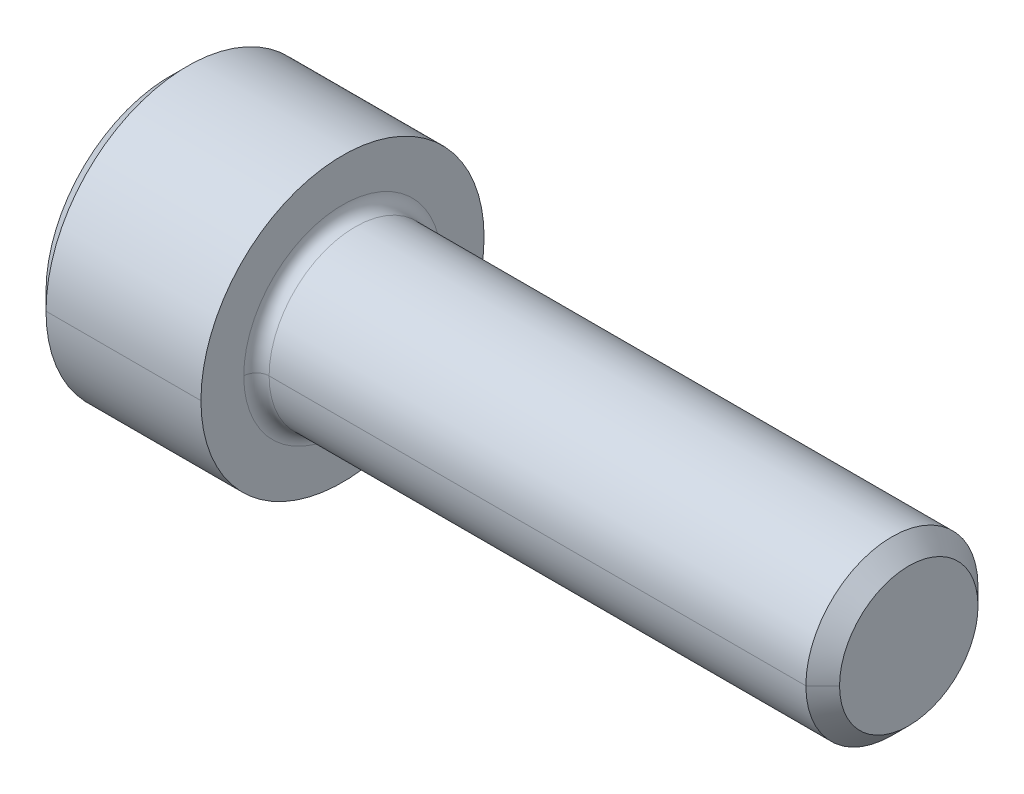
ISO-10303-21;
HEADER;
FILE_DESCRIPTION(('STEP AP214'),'2;1');
FILE_NAME('part.step','',(''),(''),'','','');
FILE_SCHEMA(('AUTOMOTIVE_DESIGN { 1 0 10303 214 1 1 1 1 }'));
ENDSEC;
DATA;
#1=APPLICATION_CONTEXT('core data for automotive mechanical design processes');
#2=APPLICATION_PROTOCOL_DEFINITION('international standard','automotive_design',2000,#1);
#3=PRODUCT_CONTEXT('',#1,'mechanical');
#4=PRODUCT('Part','Part','',(#3));
#5=PRODUCT_RELATED_PRODUCT_CATEGORY('part','',(#4));
#6=PRODUCT_DEFINITION_FORMATION('','',#4);
#7=PRODUCT_DEFINITION_CONTEXT('part definition',#1,'design');
#8=PRODUCT_DEFINITION('design','',#6,#7);
#9=PRODUCT_DEFINITION_SHAPE('','',#8);
#10=(LENGTH_UNIT() NAMED_UNIT(*) SI_UNIT(.MILLI.,.METRE.));
#11=(NAMED_UNIT(*) PLANE_ANGLE_UNIT() SI_UNIT($,.RADIAN.));
#12=(NAMED_UNIT(*) SI_UNIT($,.STERADIAN.) SOLID_ANGLE_UNIT());
#13=UNCERTAINTY_MEASURE_WITH_UNIT(LENGTH_MEASURE(1.E-05),#10,'distance_accuracy_value','');
#14=(GEOMETRIC_REPRESENTATION_CONTEXT(3) GLOBAL_UNCERTAINTY_ASSIGNED_CONTEXT((#13)) GLOBAL_UNIT_ASSIGNED_CONTEXT((#10,
#11,#12)) REPRESENTATION_CONTEXT('',''));
#15=CARTESIAN_POINT('',(0.,0.,0.));
#16=DIRECTION('',(0.,0.,1.));
#17=DIRECTION('',(1.,0.,0.));
#18=AXIS2_PLACEMENT_3D('',#15,#16,#17);
#19=CARTESIAN_POINT('',(2.286,0.,0.));
#20=DIRECTION('',(-1.,0.,0.));
#21=DIRECTION('',(0.,0.,1.));
#22=AXIS2_PLACEMENT_3D('',#19,#20,#21);
#23=CONICAL_SURFACE('',#22,1.98501,1.0471975511966);
#24=DIRECTION('',(-0.5,0.,-0.866025403784437));
#25=VECTOR('',#24,1.);
#26=CARTESIAN_POINT('',(2.286,0.,-1.98501));
#27=LINE('',#26,#25);
#28=CARTESIAN_POINT('',(3.43204605784411,0.,0.));
#29=VERTEX_POINT('',#28);
#30=CARTESIAN_POINT('',(2.286,0.,-1.98501));
#31=VERTEX_POINT('',#30);
#32=EDGE_CURVE('E173',#29,#31,#27,.T.);
#33=ORIENTED_EDGE('',*,*,#32,.F.);
#34=DIRECTION('',(-0.5,0.,0.866025403784437));
#35=VECTOR('',#34,1.);
#36=CARTESIAN_POINT('',(2.286,0.,1.98501));
#37=LINE('',#36,#35);
#38=CARTESIAN_POINT('',(2.286,0.,1.98501));
#39=VERTEX_POINT('',#38);
#40=EDGE_CURVE('E179',#29,#39,#37,.T.);
#41=ORIENTED_EDGE('',*,*,#40,.T.);
#42=CARTESIAN_POINT('',(2.286,0.,0.));
#43=DIRECTION('',(-1.,0.,0.));
#44=DIRECTION('',(0.,0.,1.));
#45=AXIS2_PLACEMENT_3D('',#42,#43,#44);
#46=CIRCLE('',#45,1.98501);
#47=CARTESIAN_POINT('',(2.286,1.71906908676615,0.992505));
#48=VERTEX_POINT('',#47);
#49=EDGE_CURVE('E11',#39,#48,#46,.T.);
#50=ORIENTED_EDGE('',*,*,#49,.T.);
#51=CARTESIAN_POINT('',(2.286,0.,0.));
#52=DIRECTION('',(-1.,0.,0.));
#53=DIRECTION('',(0.,0.,1.));
#54=AXIS2_PLACEMENT_3D('',#51,#52,#53);
#55=CIRCLE('',#54,1.98501);
#56=CARTESIAN_POINT('',(2.286,1.71906908676615,-0.992505));
#57=VERTEX_POINT('',#56);
#58=EDGE_CURVE('E20',#48,#57,#55,.T.);
#59=ORIENTED_EDGE('',*,*,#58,.T.);
#60=CARTESIAN_POINT('',(2.286,0.,0.));
#61=DIRECTION('',(-1.,0.,0.));
#62=DIRECTION('',(0.,0.,1.));
#63=AXIS2_PLACEMENT_3D('',#60,#61,#62);
#64=CIRCLE('',#63,1.98501);
#65=EDGE_CURVE('E176',#57,#31,#64,.T.);
#66=ORIENTED_EDGE('',*,*,#65,.T.);
#67=EDGE_LOOP('',(#33,#41,#50,#59,#66));
#68=FACE_BOUND('',#67,.T.);
#69=ADVANCED_FACE('F17',(#68),#23,.F.);
#70=CARTESIAN_POINT('',(2.286,1.14604605784411,1.98501));
#71=DIRECTION('',(-1.,0.,0.));
#72=DIRECTION('',(0.,0.,1.));
#73=AXIS2_PLACEMENT_3D('',#70,#71,#72);
#74=PLANE('',#73);
#75=ORIENTED_EDGE('',*,*,#49,.F.);
#76=DIRECTION('',(0.,1.,0.));
#77=VECTOR('',#76,1.);
#78=CARTESIAN_POINT('',(2.286,-1.14604605784409,1.98501));
#79=LINE('',#78,#77);
#80=CARTESIAN_POINT('',(2.286,1.14604605784411,1.98501));
#81=VERTEX_POINT('',#80);
#82=EDGE_CURVE('E206',#39,#81,#79,.T.);
#83=ORIENTED_EDGE('',*,*,#82,.T.);
#84=DIRECTION('',(0.,-0.5,0.86602540378444));
#85=VECTOR('',#84,1.);
#86=CARTESIAN_POINT('',(2.286,2.29209211568821,0.));
#87=LINE('',#86,#85);
#88=EDGE_CURVE('E210',#48,#81,#87,.T.);
#89=ORIENTED_EDGE('',*,*,#88,.F.);
#90=EDGE_LOOP('',(#75,#83,#89));
#91=FACE_BOUND('',#90,.T.);
#92=ADVANCED_FACE('F784',(#91),#74,.T.);
#93=CARTESIAN_POINT('',(2.286,1.14604605784411,1.98501));
#94=DIRECTION('',(-1.,0.,0.));
#95=DIRECTION('',(0.,0.,1.));
#96=AXIS2_PLACEMENT_3D('',#93,#94,#95);
#97=PLANE('',#96);
#98=ORIENTED_EDGE('',*,*,#58,.F.);
#99=DIRECTION('',(0.,-0.5,0.86602540378444));
#100=VECTOR('',#99,1.);
#101=CARTESIAN_POINT('',(2.286,2.29209211568821,0.));
#102=LINE('',#101,#100);
#103=CARTESIAN_POINT('',(2.286,2.29209211568821,0.));
#104=VERTEX_POINT('',#103);
#105=EDGE_CURVE('E235',#104,#48,#102,.T.);
#106=ORIENTED_EDGE('',*,*,#105,.F.);
#107=DIRECTION('',(0.,-0.5,-0.866025403784438));
#108=VECTOR('',#107,1.);
#109=CARTESIAN_POINT('',(2.286,2.29209211568821,0.));
#110=LINE('',#109,#108);
#111=EDGE_CURVE('E296',#104,#57,#110,.T.);
#112=ORIENTED_EDGE('',*,*,#111,.T.);
#113=EDGE_LOOP('',(#98,#106,#112));
#114=FACE_BOUND('',#113,.T.);
#115=ADVANCED_FACE('F677',(#114),#97,.T.);
#116=CARTESIAN_POINT('',(2.286,1.14604605784411,1.98501));
#117=DIRECTION('',(-1.,0.,0.));
#118=DIRECTION('',(0.,0.,1.));
#119=AXIS2_PLACEMENT_3D('',#116,#117,#118);
#120=PLANE('',#119);
#121=ORIENTED_EDGE('',*,*,#65,.F.);
#122=DIRECTION('',(0.,-0.5,-0.866025403784438));
#123=VECTOR('',#122,1.);
#124=CARTESIAN_POINT('',(2.286,2.29209211568821,0.));
#125=LINE('',#124,#123);
#126=CARTESIAN_POINT('',(2.286,1.1460460578441,-1.98501));
#127=VERTEX_POINT('',#126);
#128=EDGE_CURVE('E50',#57,#127,#125,.T.);
#129=ORIENTED_EDGE('',*,*,#128,.T.);
#130=DIRECTION('',(0.,-1.,0.));
#131=VECTOR('',#130,1.);
#132=CARTESIAN_POINT('',(2.286,1.1460460578441,-1.98501));
#133=LINE('',#132,#131);
#134=EDGE_CURVE('E355',#127,#31,#133,.T.);
#135=ORIENTED_EDGE('',*,*,#134,.T.);
#136=EDGE_LOOP('',(#121,#129,#135));
#137=FACE_BOUND('',#136,.T.);
#138=ADVANCED_FACE('F673',(#137),#120,.T.);
#139=CARTESIAN_POINT('',(2.286,1.14604605784411,1.98501));
#140=DIRECTION('',(-1.,0.,0.));
#141=DIRECTION('',(0.,0.,1.));
#142=AXIS2_PLACEMENT_3D('',#139,#140,#141);
#143=PLANE('',#142);
#144=CARTESIAN_POINT('',(2.286,0.,0.));
#145=DIRECTION('',(-1.,0.,0.));
#146=DIRECTION('',(0.,0.,1.));
#147=AXIS2_PLACEMENT_3D('',#144,#145,#146);
#148=CIRCLE('',#147,1.98501);
#149=CARTESIAN_POINT('',(2.286,-1.71906908676615,-0.992505));
#150=VERTEX_POINT('',#149);
#151=EDGE_CURVE('E185',#31,#150,#148,.T.);
#152=ORIENTED_EDGE('',*,*,#151,.F.);
#153=DIRECTION('',(0.,-1.,0.));
#154=VECTOR('',#153,1.);
#155=CARTESIAN_POINT('',(2.286,1.1460460578441,-1.98501));
#156=LINE('',#155,#154);
#157=CARTESIAN_POINT('',(2.286,-1.1460460578441,-1.98501));
#158=VERTEX_POINT('',#157);
#159=EDGE_CURVE('E213',#31,#158,#156,.T.);
#160=ORIENTED_EDGE('',*,*,#159,.T.);
#161=DIRECTION('',(0.,0.5,-0.86602540378444));
#162=VECTOR('',#161,1.);
#163=CARTESIAN_POINT('',(2.286,-2.2920921156882,0.));
#164=LINE('',#163,#162);
#165=EDGE_CURVE('E212',#150,#158,#164,.T.);
#166=ORIENTED_EDGE('',*,*,#165,.F.);
#167=EDGE_LOOP('',(#152,#160,#166));
#168=FACE_BOUND('',#167,.T.);
#169=ADVANCED_FACE('F678',(#168),#143,.T.);
#170=CARTESIAN_POINT('',(2.286,1.14604605784411,1.98501));
#171=DIRECTION('',(-1.,0.,0.));
#172=DIRECTION('',(0.,0.,1.));
#173=AXIS2_PLACEMENT_3D('',#170,#171,#172);
#174=PLANE('',#173);
#175=CARTESIAN_POINT('',(2.286,0.,0.));
#176=DIRECTION('',(-1.,0.,0.));
#177=DIRECTION('',(0.,0.,1.));
#178=AXIS2_PLACEMENT_3D('',#175,#176,#177);
#179=CIRCLE('',#178,1.98501);
#180=CARTESIAN_POINT('',(2.286,-1.71906908676614,0.992505));
#181=VERTEX_POINT('',#180);
#182=EDGE_CURVE('E205',#150,#181,#179,.T.);
#183=ORIENTED_EDGE('',*,*,#182,.F.);
#184=DIRECTION('',(0.,0.5,-0.86602540378444));
#185=VECTOR('',#184,1.);
#186=CARTESIAN_POINT('',(2.286,-2.2920921156882,0.));
#187=LINE('',#186,#185);
#188=CARTESIAN_POINT('',(2.286,-2.2920921156882,0.));
#189=VERTEX_POINT('',#188);
#190=EDGE_CURVE('E267',#189,#150,#187,.T.);
#191=ORIENTED_EDGE('',*,*,#190,.F.);
#192=DIRECTION('',(0.,-0.5,-0.866025403784438));
#193=VECTOR('',#192,1.);
#194=CARTESIAN_POINT('',(2.286,-1.14604605784409,1.98501));
#195=LINE('',#194,#193);
#196=EDGE_CURVE('E351',#181,#189,#195,.T.);
#197=ORIENTED_EDGE('',*,*,#196,.F.);
#198=EDGE_LOOP('',(#183,#191,#197));
#199=FACE_BOUND('',#198,.T.);
#200=ADVANCED_FACE('F862',(#199),#174,.T.);
#201=CARTESIAN_POINT('',(2.286,1.14604605784411,1.98501));
#202=DIRECTION('',(-1.,0.,0.));
#203=DIRECTION('',(0.,0.,1.));
#204=AXIS2_PLACEMENT_3D('',#201,#202,#203);
#205=PLANE('',#204);
#206=CARTESIAN_POINT('',(2.286,0.,0.));
#207=DIRECTION('',(-1.,0.,0.));
#208=DIRECTION('',(0.,0.,1.));
#209=AXIS2_PLACEMENT_3D('',#206,#207,#208);
#210=CIRCLE('',#209,1.98501);
#211=EDGE_CURVE('E190',#181,#39,#210,.T.);
#212=ORIENTED_EDGE('',*,*,#211,.F.);
#213=DIRECTION('',(0.,-0.5,-0.866025403784438));
#214=VECTOR('',#213,1.);
#215=CARTESIAN_POINT('',(2.286,-1.14604605784409,1.98501));
#216=LINE('',#215,#214);
#217=CARTESIAN_POINT('',(2.286,-1.14604605784409,1.98501));
#218=VERTEX_POINT('',#217);
#219=EDGE_CURVE('E346',#218,#181,#216,.T.);
#220=ORIENTED_EDGE('',*,*,#219,.F.);
#221=DIRECTION('',(0.,1.,0.));
#222=VECTOR('',#221,1.);
#223=CARTESIAN_POINT('',(2.286,-1.14604605784409,1.98501));
#224=LINE('',#223,#222);
#225=EDGE_CURVE('E336',#218,#39,#224,.T.);
#226=ORIENTED_EDGE('',*,*,#225,.T.);
#227=EDGE_LOOP('',(#212,#220,#226));
#228=FACE_BOUND('',#227,.T.);
#229=ADVANCED_FACE('F858',(#228),#205,.T.);
#230=CARTESIAN_POINT('',(2.286,2.29209211568821,0.));
#231=DIRECTION('',(0.,0.866025403784438,-0.5));
#232=DIRECTION('',(-1.,0.,0.));
#233=AXIS2_PLACEMENT_3D('',#230,#231,#232);
#234=PLANE('',#233);
#235=DIRECTION('',(0.,-0.5,-0.866025403784438));
#236=VECTOR('',#235,1.);
#237=CARTESIAN_POINT('',(0.,2.29209211568821,0.));
#238=LINE('',#237,#236);
#239=CARTESIAN_POINT('',(0.,2.29209211568821,0.));
#240=VERTEX_POINT('',#239);
#241=CARTESIAN_POINT('',(0.,1.1460460578441,-1.98501));
#242=VERTEX_POINT('',#241);
#243=EDGE_CURVE('E314',#240,#242,#238,.T.);
#244=ORIENTED_EDGE('',*,*,#243,.T.);
#245=DIRECTION('',(-1.,0.,0.));
#246=VECTOR('',#245,1.);
#247=CARTESIAN_POINT('',(2.286,1.1460460578441,-1.98501));
#248=LINE('',#247,#246);
#249=EDGE_CURVE('E354',#127,#242,#248,.T.);
#250=ORIENTED_EDGE('',*,*,#249,.F.);
#251=ORIENTED_EDGE('',*,*,#128,.F.);
#252=ORIENTED_EDGE('',*,*,#111,.F.);
#253=DIRECTION('',(-1.,0.,0.));
#254=VECTOR('',#253,1.);
#255=CARTESIAN_POINT('',(2.286,2.29209211568821,0.));
#256=LINE('',#255,#254);
#257=EDGE_CURVE('E236',#104,#240,#256,.T.);
#258=ORIENTED_EDGE('',*,*,#257,.T.);
#259=EDGE_LOOP('',(#244,#250,#251,#252,#258));
#260=FACE_BOUND('',#259,.T.);
#261=ADVANCED_FACE('F850',(#260),#234,.F.);
#262=CARTESIAN_POINT('',(2.286,1.1460460578441,-1.98501));
#263=DIRECTION('',(0.,0.,-1.));
#264=DIRECTION('',(0.,-1.,0.));
#265=AXIS2_PLACEMENT_3D('',#262,#263,#264);
#266=PLANE('',#265);
#267=DIRECTION('',(0.,-1.,0.));
#268=VECTOR('',#267,1.);
#269=CARTESIAN_POINT('',(0.,1.1460460578441,-1.98501));
#270=LINE('',#269,#268);
#271=CARTESIAN_POINT('',(0.,-1.1460460578441,-1.98501));
#272=VERTEX_POINT('',#271);
#273=EDGE_CURVE('E309',#242,#272,#270,.T.);
#274=ORIENTED_EDGE('',*,*,#273,.T.);
#275=DIRECTION('',(-1.,0.,0.));
#276=VECTOR('',#275,1.);
#277=CARTESIAN_POINT('',(2.286,-1.1460460578441,-1.98501));
#278=LINE('',#277,#276);
#279=EDGE_CURVE('E209',#158,#272,#278,.T.);
#280=ORIENTED_EDGE('',*,*,#279,.F.);
#281=ORIENTED_EDGE('',*,*,#159,.F.);
#282=ORIENTED_EDGE('',*,*,#134,.F.);
#283=ORIENTED_EDGE('',*,*,#249,.T.);
#284=EDGE_LOOP('',(#274,#280,#281,#282,#283));
#285=FACE_BOUND('',#284,.T.);
#286=ADVANCED_FACE('F840',(#285),#266,.F.);
#287=CARTESIAN_POINT('',(2.286,-2.2920921156882,0.));
#288=DIRECTION('',(0.,0.866025403784439,0.5));
#289=DIRECTION('',(1.,0.,0.));
#290=AXIS2_PLACEMENT_3D('',#287,#288,#289);
#291=PLANE('',#290);
#292=DIRECTION('',(0.,0.5,-0.86602540378444));
#293=VECTOR('',#292,1.);
#294=CARTESIAN_POINT('',(0.,-2.2920921156882,0.));
#295=LINE('',#294,#293);
#296=CARTESIAN_POINT('',(0.,-2.2920921156882,0.));
#297=VERTEX_POINT('',#296);
#298=EDGE_CURVE('E308',#297,#272,#295,.T.);
#299=ORIENTED_EDGE('',*,*,#298,.F.);
#300=DIRECTION('',(-1.,0.,0.));
#301=VECTOR('',#300,1.);
#302=CARTESIAN_POINT('',(2.286,-2.2920921156882,0.));
#303=LINE('',#302,#301);
#304=EDGE_CURVE('E356',#189,#297,#303,.T.);
#305=ORIENTED_EDGE('',*,*,#304,.F.);
#306=ORIENTED_EDGE('',*,*,#190,.T.);
#307=ORIENTED_EDGE('',*,*,#165,.T.);
#308=ORIENTED_EDGE('',*,*,#279,.T.);
#309=EDGE_LOOP('',(#299,#305,#306,#307,#308));
#310=FACE_BOUND('',#309,.T.);
#311=ADVANCED_FACE('F826',(#310),#291,.T.);
#312=CARTESIAN_POINT('',(2.286,-1.14604605784409,1.98501));
#313=DIRECTION('',(0.,0.866025403784438,-0.5));
#314=DIRECTION('',(-1.,0.,0.));
#315=AXIS2_PLACEMENT_3D('',#312,#313,#314);
#316=PLANE('',#315);
#317=DIRECTION('',(0.,-0.5,-0.866025403784438));
#318=VECTOR('',#317,1.);
#319=CARTESIAN_POINT('',(0.,-1.14604605784409,1.98501));
#320=LINE('',#319,#318);
#321=CARTESIAN_POINT('',(0.,-1.14604605784409,1.98501));
#322=VERTEX_POINT('',#321);
#323=EDGE_CURVE('E218',#322,#297,#320,.T.);
#324=ORIENTED_EDGE('',*,*,#323,.F.);
#325=DIRECTION('',(-1.,0.,0.));
#326=VECTOR('',#325,1.);
#327=CARTESIAN_POINT('',(2.286,-1.14604605784409,1.98501));
#328=LINE('',#327,#326);
#329=EDGE_CURVE('E343',#218,#322,#328,.T.);
#330=ORIENTED_EDGE('',*,*,#329,.F.);
#331=ORIENTED_EDGE('',*,*,#219,.T.);
#332=ORIENTED_EDGE('',*,*,#196,.T.);
#333=ORIENTED_EDGE('',*,*,#304,.T.);
#334=EDGE_LOOP('',(#324,#330,#331,#332,#333));
#335=FACE_BOUND('',#334,.T.);
#336=ADVANCED_FACE('F718',(#335),#316,.T.);
#337=CARTESIAN_POINT('',(2.286,-1.14604605784409,1.98501));
#338=DIRECTION('',(0.,0.,1.));
#339=DIRECTION('',(0.,-1.,0.));
#340=AXIS2_PLACEMENT_3D('',#337,#338,#339);
#341=PLANE('',#340);
#342=DIRECTION('',(0.,1.,0.));
#343=VECTOR('',#342,1.);
#344=CARTESIAN_POINT('',(0.,-1.14604605784409,1.98501));
#345=LINE('',#344,#343);
#346=CARTESIAN_POINT('',(0.,1.14604605784411,1.98501));
#347=VERTEX_POINT('',#346);
#348=EDGE_CURVE('E214',#322,#347,#345,.T.);
#349=ORIENTED_EDGE('',*,*,#348,.T.);
#350=DIRECTION('',(-1.,0.,0.));
#351=VECTOR('',#350,1.);
#352=CARTESIAN_POINT('',(2.286,1.14604605784411,1.98501));
#353=LINE('',#352,#351);
#354=EDGE_CURVE('E201',#81,#347,#353,.T.);
#355=ORIENTED_EDGE('',*,*,#354,.F.);
#356=ORIENTED_EDGE('',*,*,#82,.F.);
#357=ORIENTED_EDGE('',*,*,#225,.F.);
#358=ORIENTED_EDGE('',*,*,#329,.T.);
#359=EDGE_LOOP('',(#349,#355,#356,#357,#358));
#360=FACE_BOUND('',#359,.T.);
#361=ADVANCED_FACE('F714',(#360),#341,.F.);
#362=CARTESIAN_POINT('',(2.286,2.29209211568821,0.));
#363=DIRECTION('',(0.,-0.86602540378444,-0.5));
#364=DIRECTION('',(0.,0.5,-0.86602540378444));
#365=AXIS2_PLACEMENT_3D('',#362,#363,#364);
#366=PLANE('',#365);
#367=DIRECTION('',(0.,-0.5,0.86602540378444));
#368=VECTOR('',#367,1.);
#369=CARTESIAN_POINT('',(0.,2.29209211568821,0.));
#370=LINE('',#369,#368);
#371=EDGE_CURVE('E219',#240,#347,#370,.T.);
#372=ORIENTED_EDGE('',*,*,#371,.F.);
#373=ORIENTED_EDGE('',*,*,#257,.F.);
#374=ORIENTED_EDGE('',*,*,#105,.T.);
#375=ORIENTED_EDGE('',*,*,#88,.T.);
#376=ORIENTED_EDGE('',*,*,#354,.T.);
#377=EDGE_LOOP('',(#372,#373,#374,#375,#376));
#378=FACE_BOUND('',#377,.T.);
#379=ADVANCED_FACE('F716',(#378),#366,.T.);
#380=CARTESIAN_POINT('',(5.1816,0.,0.));
#381=DIRECTION('',(1.,0.,0.));
#382=DIRECTION('',(0.,0.,-1.));
#383=AXIS2_PLACEMENT_3D('',#380,#381,#382);
#384=TOROIDAL_SURFACE('',#383,2.7686,0.3556);
#385=CARTESIAN_POINT('',(5.1816,0.,2.7686));
#386=DIRECTION('',(0.,1.,0.));
#387=DIRECTION('',(0.,0.,1.));
#388=AXIS2_PLACEMENT_3D('',#385,#386,#387);
#389=CIRCLE('',#388,0.3556);
#390=CARTESIAN_POINT('',(5.1816,0.,2.413));
#391=VERTEX_POINT('',#390);
#392=CARTESIAN_POINT('',(4.826,0.,2.7686));
#393=VERTEX_POINT('',#392);
#394=EDGE_CURVE('E200',#391,#393,#389,.T.);
#395=ORIENTED_EDGE('',*,*,#394,.F.);
#396=CARTESIAN_POINT('',(5.1816,0.,0.));
#397=DIRECTION('',(1.,0.,0.));
#398=DIRECTION('',(0.,0.,-1.));
#399=AXIS2_PLACEMENT_3D('',#396,#397,#398);
#400=CIRCLE('',#399,2.413);
#401=CARTESIAN_POINT('',(5.1816,0.,-2.413));
#402=VERTEX_POINT('',#401);
#403=EDGE_CURVE('E265',#402,#391,#400,.T.);
#404=ORIENTED_EDGE('',*,*,#403,.F.);
#405=CARTESIAN_POINT('',(5.1816,0.,-2.7686));
#406=DIRECTION('',(0.,-1.,0.));
#407=DIRECTION('',(0.,0.,-1.));
#408=AXIS2_PLACEMENT_3D('',#405,#406,#407);
#409=CIRCLE('',#408,0.3556);
#410=CARTESIAN_POINT('',(4.826,0.,-2.7686));
#411=VERTEX_POINT('',#410);
#412=EDGE_CURVE('E241',#402,#411,#409,.T.);
#413=ORIENTED_EDGE('',*,*,#412,.T.);
#414=CARTESIAN_POINT('',(4.826,0.,0.));
#415=DIRECTION('',(-1.,0.,0.));
#416=DIRECTION('',(0.,0.,-1.));
#417=AXIS2_PLACEMENT_3D('',#414,#415,#416);
#418=CIRCLE('',#417,2.7686);
#419=EDGE_CURVE('E322',#393,#411,#418,.T.);
#420=ORIENTED_EDGE('',*,*,#419,.F.);
#421=EDGE_LOOP('',(#395,#404,#413,#420));
#422=FACE_BOUND('',#421,.T.);
#423=ADVANCED_FACE('F745',(#422),#384,.F.);
#424=CARTESIAN_POINT('',(20.701,1.94056,0.));
#425=DIRECTION('',(1.,0.,0.));
#426=DIRECTION('',(0.,1.,0.));
#427=AXIS2_PLACEMENT_3D('',#424,#425,#426);
#428=PLANE('',#427);
#429=CARTESIAN_POINT('',(20.701,0.,0.));
#430=DIRECTION('',(-1.,0.,0.));
#431=DIRECTION('',(0.,0.,1.));
#432=AXIS2_PLACEMENT_3D('',#429,#430,#431);
#433=CIRCLE('',#432,1.94056);
#434=CARTESIAN_POINT('',(20.701,0.,1.94056));
#435=VERTEX_POINT('',#434);
#436=CARTESIAN_POINT('',(20.701,0.,-1.94056));
#437=VERTEX_POINT('',#436);
#438=EDGE_CURVE('E250',#435,#437,#433,.T.);
#439=ORIENTED_EDGE('',*,*,#438,.F.);
#440=CARTESIAN_POINT('',(20.701,0.,0.));
#441=DIRECTION('',(-1.,0.,0.));
#442=DIRECTION('',(0.,0.,1.));
#443=AXIS2_PLACEMENT_3D('',#440,#441,#442);
#444=CIRCLE('',#443,1.94056);
#445=EDGE_CURVE('E334',#437,#435,#444,.T.);
#446=ORIENTED_EDGE('',*,*,#445,.F.);
#447=EDGE_LOOP('',(#439,#446));
#448=FACE_BOUND('',#447,.T.);
#449=ADVANCED_FACE('F686',(#448),#428,.T.);
#450=CARTESIAN_POINT('',(20.701,0.,0.));
#451=DIRECTION('',(-1.,0.,0.));
#452=DIRECTION('',(0.,0.,1.));
#453=AXIS2_PLACEMENT_3D('',#450,#451,#452);
#454=CONICAL_SURFACE('',#453,1.94056,0.785398163397408);
#455=DIRECTION('',(-0.707106781186576,0.,-0.707106781186519));
#456=VECTOR('',#455,1.);
#457=CARTESIAN_POINT('',(20.701,0.,-1.94056));
#458=LINE('',#457,#456);
#459=CARTESIAN_POINT('',(20.22856,0.,-2.41299999999997));
#460=VERTEX_POINT('',#459);
#461=EDGE_CURVE('E245',#437,#460,#458,.T.);
#462=ORIENTED_EDGE('',*,*,#461,.F.);
#463=ORIENTED_EDGE('',*,*,#445,.T.);
#464=DIRECTION('',(-0.707106781186576,0.,0.707106781186519));
#465=VECTOR('',#464,1.);
#466=CARTESIAN_POINT('',(20.701,0.,1.94056));
#467=LINE('',#466,#465);
#468=CARTESIAN_POINT('',(20.22856,0.,2.41299999999997));
#469=VERTEX_POINT('',#468);
#470=EDGE_CURVE('E255',#435,#469,#467,.T.);
#471=ORIENTED_EDGE('',*,*,#470,.T.);
#472=CARTESIAN_POINT('',(20.22856,0.,0.));
#473=DIRECTION('',(-1.,0.,0.));
#474=DIRECTION('',(0.,0.,1.));
#475=AXIS2_PLACEMENT_3D('',#472,#473,#474);
#476=CIRCLE('',#475,2.41299999999997);
#477=EDGE_CURVE('E329',#460,#469,#476,.T.);
#478=ORIENTED_EDGE('',*,*,#477,.F.);
#479=EDGE_LOOP('',(#462,#463,#471,#478));
#480=FACE_BOUND('',#479,.T.);
#481=ADVANCED_FACE('F683',(#480),#454,.T.);
#482=CARTESIAN_POINT('',(-31.75,0.,0.));
#483=DIRECTION('',(-1.,0.,0.));
#484=DIRECTION('',(0.,0.,1.));
#485=AXIS2_PLACEMENT_3D('',#482,#483,#484);
#486=CYLINDRICAL_SURFACE('',#485,2.413);
#487=DIRECTION('',(-1.,0.,0.));
#488=VECTOR('',#487,1.);
#489=CARTESIAN_POINT('',(-31.75,0.,-2.413));
#490=LINE('',#489,#488);
#491=EDGE_CURVE('E256',#460,#402,#490,.T.);
#492=ORIENTED_EDGE('',*,*,#491,.F.);
#493=ORIENTED_EDGE('',*,*,#477,.T.);
#494=DIRECTION('',(-1.,0.,0.));
#495=VECTOR('',#494,1.);
#496=CARTESIAN_POINT('',(-31.75,0.,2.413));
#497=LINE('',#496,#495);
#498=EDGE_CURVE('E229',#469,#391,#497,.T.);
#499=ORIENTED_EDGE('',*,*,#498,.T.);
#500=CARTESIAN_POINT('',(5.1816,0.,0.));
#501=DIRECTION('',(1.,0.,0.));
#502=DIRECTION('',(0.,0.,-1.));
#503=AXIS2_PLACEMENT_3D('',#500,#501,#502);
#504=CIRCLE('',#503,2.413);
#505=EDGE_CURVE('E193',#391,#402,#504,.T.);
#506=ORIENTED_EDGE('',*,*,#505,.T.);
#507=EDGE_LOOP('',(#492,#493,#499,#506));
#508=FACE_BOUND('',#507,.T.);
#509=ADVANCED_FACE('F689',(#508),#486,.T.);
#510=CARTESIAN_POINT('',(4.826,3.96875,0.));
#511=DIRECTION('',(1.,0.,0.));
#512=DIRECTION('',(0.,1.,0.));
#513=AXIS2_PLACEMENT_3D('',#510,#511,#512);
#514=PLANE('',#513);
#515=CARTESIAN_POINT('',(4.826,0.,0.));
#516=DIRECTION('',(-1.,0.,0.));
#517=DIRECTION('',(0.,0.,-1.));
#518=AXIS2_PLACEMENT_3D('',#515,#516,#517);
#519=CIRCLE('',#518,2.7686);
#520=EDGE_CURVE('E231',#411,#393,#519,.T.);
#521=ORIENTED_EDGE('',*,*,#520,.T.);
#522=ORIENTED_EDGE('',*,*,#419,.T.);
#523=EDGE_LOOP('',(#521,#522));
#524=FACE_BOUND('',#523,.T.);
#525=CARTESIAN_POINT('',(4.826,0.,0.));
#526=DIRECTION('',(-1.,0.,0.));
#527=DIRECTION('',(0.,0.,1.));
#528=AXIS2_PLACEMENT_3D('',#525,#526,#527);
#529=CIRCLE('',#528,3.96875);
#530=CARTESIAN_POINT('',(4.826,0.,3.96875));
#531=VERTEX_POINT('',#530);
#532=CARTESIAN_POINT('',(4.826,0.,-3.96875));
#533=VERTEX_POINT('',#532);
#534=EDGE_CURVE('E224',#531,#533,#529,.T.);
#535=ORIENTED_EDGE('',*,*,#534,.F.);
#536=CARTESIAN_POINT('',(4.826,0.,0.));
#537=DIRECTION('',(-1.,0.,0.));
#538=DIRECTION('',(0.,0.,1.));
#539=AXIS2_PLACEMENT_3D('',#536,#537,#538);
#540=CIRCLE('',#539,3.96875);
#541=EDGE_CURVE('E321',#533,#531,#540,.T.);
#542=ORIENTED_EDGE('',*,*,#541,.F.);
#543=EDGE_LOOP('',(#535,#542));
#544=FACE_BOUND('',#543,.T.);
#545=ADVANCED_FACE('F802',(#524,#544),#514,.T.);
#546=CARTESIAN_POINT('',(-31.75,0.,0.));
#547=DIRECTION('',(-1.,0.,0.));
#548=DIRECTION('',(0.,0.,1.));
#549=AXIS2_PLACEMENT_3D('',#546,#547,#548);
#550=CYLINDRICAL_SURFACE('',#549,3.96875);
#551=DIRECTION('',(-1.,0.,0.));
#552=VECTOR('',#551,1.);
#553=CARTESIAN_POINT('',(-31.75,0.,-3.96875));
#554=LINE('',#553,#552);
#555=CARTESIAN_POINT('',(0.4826,0.,-3.96875));
#556=VERTEX_POINT('',#555);
#557=EDGE_CURVE('E227',#533,#556,#554,.T.);
#558=ORIENTED_EDGE('',*,*,#557,.F.);
#559=ORIENTED_EDGE('',*,*,#541,.T.);
#560=DIRECTION('',(-1.,0.,0.));
#561=VECTOR('',#560,1.);
#562=CARTESIAN_POINT('',(-31.75,0.,3.96875));
#563=LINE('',#562,#561);
#564=CARTESIAN_POINT('',(0.4826,0.,3.96875));
#565=VERTEX_POINT('',#564);
#566=EDGE_CURVE('E280',#531,#565,#563,.T.);
#567=ORIENTED_EDGE('',*,*,#566,.T.);
#568=CARTESIAN_POINT('',(0.4826,0.,0.));
#569=DIRECTION('',(-1.,0.,0.));
#570=DIRECTION('',(0.,0.,1.));
#571=AXIS2_PLACEMENT_3D('',#568,#569,#570);
#572=CIRCLE('',#571,3.96875);
#573=EDGE_CURVE('E320',#556,#565,#572,.T.);
#574=ORIENTED_EDGE('',*,*,#573,.F.);
#575=EDGE_LOOP('',(#558,#559,#567,#574));
#576=FACE_BOUND('',#575,.T.);
#577=ADVANCED_FACE('F792',(#576),#550,.T.);
#578=CARTESIAN_POINT('',(0.,0.,0.));
#579=DIRECTION('',(1.,0.,0.));
#580=DIRECTION('',(0.,0.,-1.));
#581=AXIS2_PLACEMENT_3D('',#578,#579,#580);
#582=CONICAL_SURFACE('',#581,3.48615,0.78539816339745);
#583=DIRECTION('',(0.707106781186546,0.,0.707106781186549));
#584=VECTOR('',#583,1.);
#585=CARTESIAN_POINT('',(0.,0.,3.48615));
#586=LINE('',#585,#584);
#587=CARTESIAN_POINT('',(0.,0.,3.48615));
#588=VERTEX_POINT('',#587);
#589=EDGE_CURVE('E285',#588,#565,#586,.T.);
#590=ORIENTED_EDGE('',*,*,#589,.F.);
#591=CARTESIAN_POINT('',(0.,0.,0.));
#592=DIRECTION('',(-1.,0.,0.));
#593=DIRECTION('',(0.,0.,1.));
#594=AXIS2_PLACEMENT_3D('',#591,#592,#593);
#595=CIRCLE('',#594,3.48615);
#596=CARTESIAN_POINT('',(0.,0.,-3.48615));
#597=VERTEX_POINT('',#596);
#598=EDGE_CURVE('E293',#597,#588,#595,.T.);
#599=ORIENTED_EDGE('',*,*,#598,.F.);
#600=DIRECTION('',(0.707106781186546,0.,-0.707106781186549));
#601=VECTOR('',#600,1.);
#602=CARTESIAN_POINT('',(0.,0.,-3.48615));
#603=LINE('',#602,#601);
#604=EDGE_CURVE('E288',#597,#556,#603,.T.);
#605=ORIENTED_EDGE('',*,*,#604,.T.);
#606=ORIENTED_EDGE('',*,*,#573,.T.);
#607=EDGE_LOOP('',(#590,#599,#605,#606));
#608=FACE_BOUND('',#607,.T.);
#609=ADVANCED_FACE('F770',(#608),#582,.T.);
#610=CARTESIAN_POINT('',(0.,0.,0.));
#611=DIRECTION('',(-1.,0.,0.));
#612=DIRECTION('',(0.,0.,1.));
#613=AXIS2_PLACEMENT_3D('',#610,#611,#612);
#614=PLANE('',#613);
#615=ORIENTED_EDGE('',*,*,#371,.T.);
#616=ORIENTED_EDGE('',*,*,#348,.F.);
#617=ORIENTED_EDGE('',*,*,#323,.T.);
#618=ORIENTED_EDGE('',*,*,#298,.T.);
#619=ORIENTED_EDGE('',*,*,#273,.F.);
#620=ORIENTED_EDGE('',*,*,#243,.F.);
#621=EDGE_LOOP('',(#615,#616,#617,#618,#619,#620));
#622=FACE_BOUND('',#621,.T.);
#623=ORIENTED_EDGE('',*,*,#598,.T.);
#624=CARTESIAN_POINT('',(0.,0.,0.));
#625=DIRECTION('',(-1.,0.,0.));
#626=DIRECTION('',(0.,0.,1.));
#627=AXIS2_PLACEMENT_3D('',#624,#625,#626);
#628=CIRCLE('',#627,3.48615);
#629=EDGE_CURVE('E281',#588,#597,#628,.T.);
#630=ORIENTED_EDGE('',*,*,#629,.T.);
#631=EDGE_LOOP('',(#623,#630));
#632=FACE_BOUND('',#631,.T.);
#633=ADVANCED_FACE('F697',(#622,#632),#614,.T.);
#634=CARTESIAN_POINT('',(0.,0.,0.));
#635=DIRECTION('',(1.,0.,0.));
#636=DIRECTION('',(0.,0.,-1.));
#637=AXIS2_PLACEMENT_3D('',#634,#635,#636);
#638=CONICAL_SURFACE('',#637,3.48615,0.78539816339745);
#639=ORIENTED_EDGE('',*,*,#629,.F.);
#640=ORIENTED_EDGE('',*,*,#589,.T.);
#641=CARTESIAN_POINT('',(0.4826,0.,0.));
#642=DIRECTION('',(-1.,0.,0.));
#643=DIRECTION('',(0.,0.,1.));
#644=AXIS2_PLACEMENT_3D('',#641,#642,#643);
#645=CIRCLE('',#644,3.96875);
#646=EDGE_CURVE('E272',#565,#556,#645,.T.);
#647=ORIENTED_EDGE('',*,*,#646,.T.);
#648=ORIENTED_EDGE('',*,*,#604,.F.);
#649=EDGE_LOOP('',(#639,#640,#647,#648));
#650=FACE_BOUND('',#649,.T.);
#651=ADVANCED_FACE('F694',(#650),#638,.T.);
#652=CARTESIAN_POINT('',(-31.75,0.,0.));
#653=DIRECTION('',(-1.,0.,0.));
#654=DIRECTION('',(0.,0.,1.));
#655=AXIS2_PLACEMENT_3D('',#652,#653,#654);
#656=CYLINDRICAL_SURFACE('',#655,3.96875);
#657=ORIENTED_EDGE('',*,*,#534,.T.);
#658=ORIENTED_EDGE('',*,*,#557,.T.);
#659=ORIENTED_EDGE('',*,*,#646,.F.);
#660=ORIENTED_EDGE('',*,*,#566,.F.);
#661=EDGE_LOOP('',(#657,#658,#659,#660));
#662=FACE_BOUND('',#661,.T.);
#663=ADVANCED_FACE('F699',(#662),#656,.T.);
#664=CARTESIAN_POINT('',(-31.75,0.,0.));
#665=DIRECTION('',(-1.,0.,0.));
#666=DIRECTION('',(0.,0.,1.));
#667=AXIS2_PLACEMENT_3D('',#664,#665,#666);
#668=CYLINDRICAL_SURFACE('',#667,2.413);
#669=CARTESIAN_POINT('',(20.22856,0.,0.));
#670=DIRECTION('',(-1.,0.,0.));
#671=DIRECTION('',(0.,0.,1.));
#672=AXIS2_PLACEMENT_3D('',#669,#670,#671);
#673=CIRCLE('',#672,2.41299999999997);
#674=EDGE_CURVE('E247',#469,#460,#673,.T.);
#675=ORIENTED_EDGE('',*,*,#674,.T.);
#676=ORIENTED_EDGE('',*,*,#491,.T.);
#677=ORIENTED_EDGE('',*,*,#403,.T.);
#678=ORIENTED_EDGE('',*,*,#498,.F.);
#679=EDGE_LOOP('',(#675,#676,#677,#678));
#680=FACE_BOUND('',#679,.T.);
#681=ADVANCED_FACE('F707',(#680),#668,.T.);
#682=CARTESIAN_POINT('',(20.701,0.,0.));
#683=DIRECTION('',(-1.,0.,0.));
#684=DIRECTION('',(0.,0.,1.));
#685=AXIS2_PLACEMENT_3D('',#682,#683,#684);
#686=CONICAL_SURFACE('',#685,1.94056,0.785398163397408);
#687=ORIENTED_EDGE('',*,*,#438,.T.);
#688=ORIENTED_EDGE('',*,*,#461,.T.);
#689=ORIENTED_EDGE('',*,*,#674,.F.);
#690=ORIENTED_EDGE('',*,*,#470,.F.);
#691=EDGE_LOOP('',(#687,#688,#689,#690));
#692=FACE_BOUND('',#691,.T.);
#693=ADVANCED_FACE('F669',(#692),#686,.T.);
#694=CARTESIAN_POINT('',(5.1816,0.,0.));
#695=DIRECTION('',(1.,0.,0.));
#696=DIRECTION('',(0.,0.,-1.));
#697=AXIS2_PLACEMENT_3D('',#694,#695,#696);
#698=TOROIDAL_SURFACE('',#697,2.7686,0.3556);
#699=ORIENTED_EDGE('',*,*,#505,.F.);
#700=ORIENTED_EDGE('',*,*,#394,.T.);
#701=ORIENTED_EDGE('',*,*,#520,.F.);
#702=ORIENTED_EDGE('',*,*,#412,.F.);
#703=EDGE_LOOP('',(#699,#700,#701,#702));
#704=FACE_BOUND('',#703,.T.);
#705=ADVANCED_FACE('F659',(#704),#698,.F.);
#706=CARTESIAN_POINT('',(2.286,0.,0.));
#707=DIRECTION('',(-1.,0.,0.));
#708=DIRECTION('',(0.,0.,1.));
#709=AXIS2_PLACEMENT_3D('',#706,#707,#708);
#710=CONICAL_SURFACE('',#709,1.98501,1.0471975511966);
#711=ORIENTED_EDGE('',*,*,#40,.F.);
#712=ORIENTED_EDGE('',*,*,#32,.T.);
#713=ORIENTED_EDGE('',*,*,#151,.T.);
#714=ORIENTED_EDGE('',*,*,#182,.T.);
#715=ORIENTED_EDGE('',*,*,#211,.T.);
#716=EDGE_LOOP('',(#711,#712,#713,#714,#715));
#717=FACE_BOUND('',#716,.T.);
#718=ADVANCED_FACE('F182',(#717),#710,.F.);
#719=CLOSED_SHELL('',(#69,#92,#115,#138,#169,#200,#229,#261,#286,#311,#336,#361,#379,#423,#449,
#481,#509,#545,#577,#609,#633,#651,#663,#681,#693,#705,#718));
#720=MANIFOLD_SOLID_BREP('B1',#719);
#721=ADVANCED_BREP_SHAPE_REPRESENTATION('',(#18,#720),#14);
#722=SHAPE_DEFINITION_REPRESENTATION(#9,#721);
ENDSEC;
END-ISO-10303-21;
